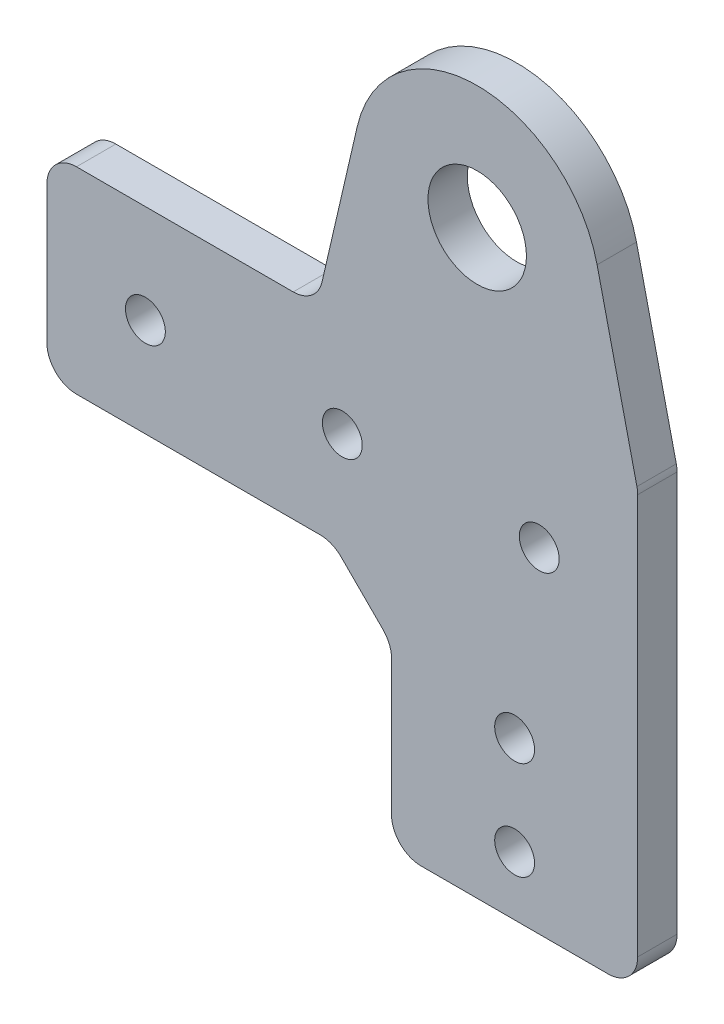
ISO-10303-21;
HEADER;
FILE_DESCRIPTION(('STEP AP214'),'2;1');
FILE_NAME('part.step','',(''),(''),'','','');
FILE_SCHEMA(('AUTOMOTIVE_DESIGN { 1 0 10303 214 1 1 1 1 }'));
ENDSEC;
DATA;
#1=APPLICATION_CONTEXT('core data for automotive mechanical design processes');
#2=APPLICATION_PROTOCOL_DEFINITION('international standard','automotive_design',2000,#1);
#3=PRODUCT_CONTEXT('',#1,'mechanical');
#4=PRODUCT('Part','Part','',(#3));
#5=PRODUCT_RELATED_PRODUCT_CATEGORY('part','',(#4));
#6=PRODUCT_DEFINITION_FORMATION('','',#4);
#7=PRODUCT_DEFINITION_CONTEXT('part definition',#1,'design');
#8=PRODUCT_DEFINITION('design','',#6,#7);
#9=PRODUCT_DEFINITION_SHAPE('','',#8);
#10=(LENGTH_UNIT() NAMED_UNIT(*) SI_UNIT(.MILLI.,.METRE.));
#11=(NAMED_UNIT(*) PLANE_ANGLE_UNIT() SI_UNIT($,.RADIAN.));
#12=(NAMED_UNIT(*) SI_UNIT($,.STERADIAN.) SOLID_ANGLE_UNIT());
#13=UNCERTAINTY_MEASURE_WITH_UNIT(LENGTH_MEASURE(1.E-05),#10,'distance_accuracy_value','');
#14=(GEOMETRIC_REPRESENTATION_CONTEXT(3) GLOBAL_UNCERTAINTY_ASSIGNED_CONTEXT((#13)) GLOBAL_UNIT_ASSIGNED_CONTEXT((#10,
#11,#12)) REPRESENTATION_CONTEXT('',''));
#15=CARTESIAN_POINT('',(0.,0.,0.));
#16=DIRECTION('',(0.,0.,1.));
#17=DIRECTION('',(1.,0.,0.));
#18=AXIS2_PLACEMENT_3D('',#15,#16,#17);
#19=CARTESIAN_POINT('',(-35.,20.,4.));
#20=DIRECTION('',(1.,0.,0.));
#21=DIRECTION('',(0.,1.,0.));
#22=AXIS2_PLACEMENT_3D('',#19,#20,#21);
#23=PLANE('',#22);
#24=DIRECTION('',(0.,-1.,0.));
#25=VECTOR('',#24,1.);
#26=CARTESIAN_POINT('',(-35.,20.,0.));
#27=LINE('',#26,#25);
#28=CARTESIAN_POINT('',(-35.,17.,0.));
#29=VERTEX_POINT('',#28);
#30=CARTESIAN_POINT('',(-35.,3.00000000000001,0.));
#31=VERTEX_POINT('',#30);
#32=EDGE_CURVE('E220',#29,#31,#27,.T.);
#33=ORIENTED_EDGE('',*,*,#32,.T.);
#34=DIRECTION('',(0.,0.,-1.));
#35=VECTOR('',#34,1.);
#36=CARTESIAN_POINT('',(-35.,3.00000000000001,4.));
#37=LINE('',#36,#35);
#38=CARTESIAN_POINT('',(-35.,3.00000000000001,4.));
#39=VERTEX_POINT('',#38);
#40=EDGE_CURVE('E298',#31,#39,#37,.F.);
#41=ORIENTED_EDGE('',*,*,#40,.T.);
#42=DIRECTION('',(0.,-1.,0.));
#43=VECTOR('',#42,1.);
#44=CARTESIAN_POINT('',(-35.,20.,4.));
#45=LINE('',#44,#43);
#46=CARTESIAN_POINT('',(-35.,17.,4.));
#47=VERTEX_POINT('',#46);
#48=EDGE_CURVE('E221',#47,#39,#45,.T.);
#49=ORIENTED_EDGE('',*,*,#48,.F.);
#50=DIRECTION('',(0.,0.,-1.));
#51=VECTOR('',#50,1.);
#52=CARTESIAN_POINT('',(-35.,17.,4.));
#53=LINE('',#52,#51);
#54=EDGE_CURVE('E295',#47,#29,#53,.T.);
#55=ORIENTED_EDGE('',*,*,#54,.T.);
#56=EDGE_LOOP('',(#33,#41,#49,#55));
#57=FACE_BOUND('',#56,.T.);
#58=ADVANCED_FACE('F35',(#57),#23,.F.);
#59=CARTESIAN_POINT('',(-35.,0.,4.));
#60=DIRECTION('',(0.,1.,0.));
#61=DIRECTION('',(0.,0.,1.));
#62=AXIS2_PLACEMENT_3D('',#59,#60,#61);
#63=PLANE('',#62);
#64=DIRECTION('',(1.,0.,0.));
#65=VECTOR('',#64,1.);
#66=CARTESIAN_POINT('',(-35.,0.,4.));
#67=LINE('',#66,#65);
#68=CARTESIAN_POINT('',(-32.,0.,4.));
#69=VERTEX_POINT('',#68);
#70=CARTESIAN_POINT('',(-7.24264068711929,0.,4.));
#71=VERTEX_POINT('',#70);
#72=EDGE_CURVE('E224',#69,#71,#67,.T.);
#73=ORIENTED_EDGE('',*,*,#72,.F.);
#74=DIRECTION('',(0.,0.,-1.));
#75=VECTOR('',#74,1.);
#76=CARTESIAN_POINT('',(-32.,0.,4.));
#77=LINE('',#76,#75);
#78=CARTESIAN_POINT('',(-32.,0.,0.));
#79=VERTEX_POINT('',#78);
#80=EDGE_CURVE('E292',#69,#79,#77,.T.);
#81=ORIENTED_EDGE('',*,*,#80,.T.);
#82=DIRECTION('',(1.,0.,0.));
#83=VECTOR('',#82,1.);
#84=CARTESIAN_POINT('',(-35.,0.,0.));
#85=LINE('',#84,#83);
#86=CARTESIAN_POINT('',(-7.24264068711929,0.,0.));
#87=VERTEX_POINT('',#86);
#88=EDGE_CURVE('E239',#79,#87,#85,.T.);
#89=ORIENTED_EDGE('',*,*,#88,.T.);
#90=DIRECTION('',(0.,0.,-1.));
#91=VECTOR('',#90,1.);
#92=CARTESIAN_POINT('',(-7.24264068711929,0.,4.));
#93=LINE('',#92,#91);
#94=EDGE_CURVE('E290',#87,#71,#93,.F.);
#95=ORIENTED_EDGE('',*,*,#94,.T.);
#96=EDGE_LOOP('',(#73,#81,#89,#95));
#97=FACE_BOUND('',#96,.T.);
#98=ADVANCED_FACE('F324',(#97),#63,.F.);
#99=CARTESIAN_POINT('',(0.,0.,4.));
#100=DIRECTION('',(1.,0.,0.));
#101=DIRECTION('',(0.,1.,0.));
#102=AXIS2_PLACEMENT_3D('',#99,#100,#101);
#103=PLANE('',#102);
#104=DIRECTION('',(0.,-1.,0.));
#105=VECTOR('',#104,1.);
#106=CARTESIAN_POINT('',(0.,0.,0.));
#107=LINE('',#106,#105);
#108=CARTESIAN_POINT('',(0.,-7.24264068711929,0.));
#109=VERTEX_POINT('',#108);
#110=CARTESIAN_POINT('',(0.,-21.,0.));
#111=VERTEX_POINT('',#110);
#112=EDGE_CURVE('E242',#109,#111,#107,.T.);
#113=ORIENTED_EDGE('',*,*,#112,.T.);
#114=DIRECTION('',(0.,0.,-1.));
#115=VECTOR('',#114,1.);
#116=CARTESIAN_POINT('',(0.,-21.,4.));
#117=LINE('',#116,#115);
#118=CARTESIAN_POINT('',(0.,-21.,4.));
#119=VERTEX_POINT('',#118);
#120=EDGE_CURVE('E50',#111,#119,#117,.F.);
#121=ORIENTED_EDGE('',*,*,#120,.T.);
#122=DIRECTION('',(0.,-1.,0.));
#123=VECTOR('',#122,1.);
#124=CARTESIAN_POINT('',(0.,0.,4.));
#125=LINE('',#124,#123);
#126=CARTESIAN_POINT('',(0.,-7.24264068711929,4.));
#127=VERTEX_POINT('',#126);
#128=EDGE_CURVE('E228',#127,#119,#125,.T.);
#129=ORIENTED_EDGE('',*,*,#128,.F.);
#130=DIRECTION('',(0.,0.,-1.));
#131=VECTOR('',#130,1.);
#132=CARTESIAN_POINT('',(0.,-7.24264068711929,4.));
#133=LINE('',#132,#131);
#134=EDGE_CURVE('E281',#127,#109,#133,.T.);
#135=ORIENTED_EDGE('',*,*,#134,.T.);
#136=EDGE_LOOP('',(#113,#121,#129,#135));
#137=FACE_BOUND('',#136,.T.);
#138=ADVANCED_FACE('F394',(#137),#103,.F.);
#139=CARTESIAN_POINT('',(25.,-30.,4.));
#140=DIRECTION('',(-1.,0.,0.));
#141=DIRECTION('',(0.,-1.,0.));
#142=AXIS2_PLACEMENT_3D('',#139,#140,#141);
#143=PLANE('',#142);
#144=DIRECTION('',(0.,1.,0.));
#145=VECTOR('',#144,1.);
#146=CARTESIAN_POINT('',(25.,-30.,4.));
#147=LINE('',#146,#145);
#148=CARTESIAN_POINT('',(25.,-21.,4.));
#149=VERTEX_POINT('',#148);
#150=CARTESIAN_POINT('',(25.,19.657531168234,4.));
#151=VERTEX_POINT('',#150);
#152=EDGE_CURVE('E230',#149,#151,#147,.T.);
#153=ORIENTED_EDGE('',*,*,#152,.F.);
#154=DIRECTION('',(0.,0.,-1.));
#155=VECTOR('',#154,1.);
#156=CARTESIAN_POINT('',(25.,-21.,4.));
#157=LINE('',#156,#155);
#158=CARTESIAN_POINT('',(25.,-21.,0.));
#159=VERTEX_POINT('',#158);
#160=EDGE_CURVE('E253',#149,#159,#157,.T.);
#161=ORIENTED_EDGE('',*,*,#160,.T.);
#162=DIRECTION('',(0.,1.,0.));
#163=VECTOR('',#162,1.);
#164=CARTESIAN_POINT('',(25.,-30.,0.));
#165=LINE('',#164,#163);
#166=CARTESIAN_POINT('',(25.,19.657531168234,0.));
#167=VERTEX_POINT('',#166);
#168=EDGE_CURVE('E244',#159,#167,#165,.T.);
#169=ORIENTED_EDGE('',*,*,#168,.T.);
#170=DIRECTION('',(0.,0.,-1.));
#171=VECTOR('',#170,1.);
#172=CARTESIAN_POINT('',(25.,19.657531168234,4.));
#173=LINE('',#172,#171);
#174=EDGE_CURVE('E251',#167,#151,#173,.F.);
#175=ORIENTED_EDGE('',*,*,#174,.T.);
#176=EDGE_LOOP('',(#153,#161,#169,#175));
#177=FACE_BOUND('',#176,.T.);
#178=ADVANCED_FACE('F433',(#177),#143,.F.);
#179=CARTESIAN_POINT('',(25.,20.,4.));
#180=DIRECTION('',(0.,-1.,0.));
#181=DIRECTION('',(1.,0.,0.));
#182=AXIS2_PLACEMENT_3D('',#179,#180,#181);
#183=PLANE('',#182);
#184=DIRECTION('',(-1.,0.,0.));
#185=VECTOR('',#184,1.);
#186=CARTESIAN_POINT('',(25.,20.,0.));
#187=LINE('',#186,#185);
#188=CARTESIAN_POINT('',(-9.98524094194186,20.,0.));
#189=VERTEX_POINT('',#188);
#190=CARTESIAN_POINT('',(-32.,20.,0.));
#191=VERTEX_POINT('',#190);
#192=EDGE_CURVE('E225',#189,#191,#187,.T.);
#193=ORIENTED_EDGE('',*,*,#192,.T.);
#194=DIRECTION('',(0.,0.,-1.));
#195=VECTOR('',#194,1.);
#196=CARTESIAN_POINT('',(-32.,20.,4.));
#197=LINE('',#196,#195);
#198=CARTESIAN_POINT('',(-32.,20.,4.));
#199=VERTEX_POINT('',#198);
#200=EDGE_CURVE('E303',#191,#199,#197,.F.);
#201=ORIENTED_EDGE('',*,*,#200,.T.);
#202=DIRECTION('',(-1.,0.,0.));
#203=VECTOR('',#202,1.);
#204=CARTESIAN_POINT('',(25.,20.,4.));
#205=LINE('',#204,#203);
#206=CARTESIAN_POINT('',(-9.98524094194186,20.,4.));
#207=VERTEX_POINT('',#206);
#208=EDGE_CURVE('E233',#207,#199,#205,.T.);
#209=ORIENTED_EDGE('',*,*,#208,.F.);
#210=DIRECTION('',(0.,0.,-1.));
#211=VECTOR('',#210,1.);
#212=CARTESIAN_POINT('',(-9.98524094194187,20.,4.));
#213=LINE('',#212,#211);
#214=EDGE_CURVE('E300',#207,#189,#213,.T.);
#215=ORIENTED_EDGE('',*,*,#214,.T.);
#216=EDGE_LOOP('',(#193,#201,#209,#215));
#217=FACE_BOUND('',#216,.T.);
#218=ADVANCED_FACE('F447',(#217),#183,.F.);
#219=CARTESIAN_POINT('',(0.,0.,4.));
#220=DIRECTION('',(0.,0.,1.));
#221=DIRECTION('',(1.,0.,0.));
#222=AXIS2_PLACEMENT_3D('',#219,#220,#221);
#223=PLANE('',#222);
#224=CARTESIAN_POINT('',(15.,10.,4.));
#225=DIRECTION('',(0.,0.,-1.));
#226=DIRECTION('',(-1.,0.,0.));
#227=AXIS2_PLACEMENT_3D('',#224,#225,#226);
#228=CIRCLE('',#227,2.025);
#229=CARTESIAN_POINT('',(12.975,10.,4.));
#230=VERTEX_POINT('',#229);
#231=EDGE_CURVE('E197',#230,#230,#228,.T.);
#232=ORIENTED_EDGE('',*,*,#231,.T.);
#233=EDGE_LOOP('',(#232));
#234=FACE_BOUND('',#233,.T.);
#235=CARTESIAN_POINT('',(-5.,10.,4.));
#236=DIRECTION('',(0.,0.,-1.));
#237=DIRECTION('',(-1.,0.,0.));
#238=AXIS2_PLACEMENT_3D('',#235,#236,#237);
#239=CIRCLE('',#238,2.025);
#240=CARTESIAN_POINT('',(-7.025,10.,4.));
#241=VERTEX_POINT('',#240);
#242=EDGE_CURVE('E346',#241,#241,#239,.T.);
#243=ORIENTED_EDGE('',*,*,#242,.T.);
#244=EDGE_LOOP('',(#243));
#245=FACE_BOUND('',#244,.T.);
#246=CARTESIAN_POINT('',(-25.,10.,4.));
#247=DIRECTION('',(0.,0.,-1.));
#248=DIRECTION('',(-1.,0.,0.));
#249=AXIS2_PLACEMENT_3D('',#246,#247,#248);
#250=CIRCLE('',#249,2.025);
#251=CARTESIAN_POINT('',(-27.025,10.,4.));
#252=VERTEX_POINT('',#251);
#253=EDGE_CURVE('E337',#252,#252,#250,.T.);
#254=ORIENTED_EDGE('',*,*,#253,.T.);
#255=EDGE_LOOP('',(#254));
#256=FACE_BOUND('',#255,.T.);
#257=DIRECTION('',(1.,0.,0.));
#258=VECTOR('',#257,1.);
#259=CARTESIAN_POINT('',(25.,-24.,4.));
#260=LINE('',#259,#258);
#261=CARTESIAN_POINT('',(3.00000000000001,-24.,4.));
#262=VERTEX_POINT('',#261);
#263=CARTESIAN_POINT('',(22.,-24.,4.));
#264=VERTEX_POINT('',#263);
#265=EDGE_CURVE('E203',#262,#264,#260,.T.);
#266=ORIENTED_EDGE('',*,*,#265,.T.);
#267=CARTESIAN_POINT('',(22.,-21.,4.));
#268=DIRECTION('',(0.,0.,1.));
#269=DIRECTION('',(1.,0.,0.));
#270=AXIS2_PLACEMENT_3D('',#267,#268,#269);
#271=CIRCLE('',#270,3.);
#272=EDGE_CURVE('E279',#264,#149,#271,.T.);
#273=ORIENTED_EDGE('',*,*,#272,.T.);
#274=ORIENTED_EDGE('',*,*,#152,.T.);
#275=CARTESIAN_POINT('',(22.,19.657531168234,4.));
#276=DIRECTION('',(0.,0.,1.));
#277=DIRECTION('',(1.,0.,0.));
#278=AXIS2_PLACEMENT_3D('',#275,#276,#277);
#279=CIRCLE('',#278,3.);
#280=CARTESIAN_POINT('',(24.9228159027552,20.3336577825611,4.));
#281=VERTEX_POINT('',#280);
#282=EDGE_CURVE('E271',#151,#281,#279,.T.);
#283=ORIENTED_EDGE('',*,*,#282,.T.);
#284=DIRECTION('',(0.225375538109041,-0.974271967585058,0.));
#285=VECTOR('',#284,1.);
#286=CARTESIAN_POINT('',(20.8783995948139,37.8171942263638,4.));
#287=LINE('',#286,#285);
#288=CARTESIAN_POINT('',(20.8783995948139,37.8171942263638,4.));
#289=VERTEX_POINT('',#288);
#290=EDGE_CURVE('E184',#289,#281,#287,.T.);
#291=ORIENTED_EDGE('',*,*,#290,.F.);
#292=CARTESIAN_POINT('',(8.70000000000071,35.0000000000008,4.));
#293=DIRECTION('',(0.,0.,1.));
#294=DIRECTION('',(1.,0.,0.));
#295=AXIS2_PLACEMENT_3D('',#292,#293,#294);
#296=CIRCLE('',#295,12.5);
#297=CARTESIAN_POINT('',(-3.47839959481276,37.8171942263627,4.));
#298=VERTEX_POINT('',#297);
#299=EDGE_CURVE('E195',#298,#289,#296,.F.);
#300=ORIENTED_EDGE('',*,*,#299,.F.);
#301=DIRECTION('',(0.225375538108956,0.974271967585078,0.));
#302=VECTOR('',#301,1.);
#303=CARTESIAN_POINT('',(-3.47839959481276,37.8171942263627,4.));
#304=LINE('',#303,#302);
#305=CARTESIAN_POINT('',(-7.06242503918664,22.3238733856731,4.));
#306=VERTEX_POINT('',#305);
#307=EDGE_CURVE('E180',#306,#298,#304,.T.);
#308=ORIENTED_EDGE('',*,*,#307,.F.);
#309=CARTESIAN_POINT('',(-9.98524094194187,23.,4.));
#310=DIRECTION('',(0.,0.,1.));
#311=DIRECTION('',(1.,0.,0.));
#312=AXIS2_PLACEMENT_3D('',#309,#310,#311);
#313=CIRCLE('',#312,3.);
#314=EDGE_CURVE('E314',#306,#207,#313,.F.);
#315=ORIENTED_EDGE('',*,*,#314,.T.);
#316=ORIENTED_EDGE('',*,*,#208,.T.);
#317=CARTESIAN_POINT('',(-32.,17.,4.));
#318=DIRECTION('',(0.,0.,1.));
#319=DIRECTION('',(1.,0.,0.));
#320=AXIS2_PLACEMENT_3D('',#317,#318,#319);
#321=CIRCLE('',#320,3.);
#322=EDGE_CURVE('E273',#199,#47,#321,.T.);
#323=ORIENTED_EDGE('',*,*,#322,.T.);
#324=ORIENTED_EDGE('',*,*,#48,.T.);
#325=CARTESIAN_POINT('',(-32.,3.,4.));
#326=DIRECTION('',(0.,0.,1.));
#327=DIRECTION('',(1.,0.,0.));
#328=AXIS2_PLACEMENT_3D('',#325,#326,#327);
#329=CIRCLE('',#328,3.);
#330=EDGE_CURVE('E275',#39,#69,#329,.T.);
#331=ORIENTED_EDGE('',*,*,#330,.T.);
#332=ORIENTED_EDGE('',*,*,#72,.T.);
#333=CARTESIAN_POINT('',(-7.24264068711929,-3.,4.));
#334=DIRECTION('',(0.,0.,1.));
#335=DIRECTION('',(1.,0.,0.));
#336=AXIS2_PLACEMENT_3D('',#333,#334,#335);
#337=CIRCLE('',#336,3.);
#338=CARTESIAN_POINT('',(-5.12132034355964,-0.878679656440356,4.));
#339=VERTEX_POINT('',#338);
#340=EDGE_CURVE('E11',#71,#339,#337,.F.);
#341=ORIENTED_EDGE('',*,*,#340,.T.);
#342=DIRECTION('',(-0.707106781186547,0.707106781186548,0.));
#343=VECTOR('',#342,1.);
#344=CARTESIAN_POINT('',(0.,-6.,4.));
#345=LINE('',#344,#343);
#346=CARTESIAN_POINT('',(-0.878679656440354,-5.12132034355965,4.));
#347=VERTEX_POINT('',#346);
#348=EDGE_CURVE('E330',#347,#339,#345,.T.);
#349=ORIENTED_EDGE('',*,*,#348,.F.);
#350=CARTESIAN_POINT('',(-3.,-7.24264068711929,4.));
#351=DIRECTION('',(0.,0.,1.));
#352=DIRECTION('',(1.,0.,0.));
#353=AXIS2_PLACEMENT_3D('',#350,#351,#352);
#354=CIRCLE('',#353,3.);
#355=EDGE_CURVE('E57',#347,#127,#354,.F.);
#356=ORIENTED_EDGE('',*,*,#355,.T.);
#357=ORIENTED_EDGE('',*,*,#128,.T.);
#358=CARTESIAN_POINT('',(3.00000000000001,-21.,4.));
#359=DIRECTION('',(0.,0.,1.));
#360=DIRECTION('',(1.,0.,0.));
#361=AXIS2_PLACEMENT_3D('',#358,#359,#360);
#362=CIRCLE('',#361,3.);
#363=EDGE_CURVE('E277',#119,#262,#362,.T.);
#364=ORIENTED_EDGE('',*,*,#363,.T.);
#365=EDGE_LOOP('',(#266,#273,#274,#283,#291,#300,#308,#315,#316,#323,#324,#331,#332,#341,#349,
#356,#357,#364));
#366=FACE_BOUND('',#365,.T.);
#367=CARTESIAN_POINT('',(12.5,-8.,4.));
#368=DIRECTION('',(0.,0.,-1.));
#369=DIRECTION('',(-1.,0.,0.));
#370=AXIS2_PLACEMENT_3D('',#367,#368,#369);
#371=CIRCLE('',#370,2.025);
#372=CARTESIAN_POINT('',(10.475,-8.,4.));
#373=VERTEX_POINT('',#372);
#374=EDGE_CURVE('E200',#373,#373,#371,.T.);
#375=ORIENTED_EDGE('',*,*,#374,.T.);
#376=EDGE_LOOP('',(#375));
#377=FACE_BOUND('',#376,.T.);
#378=CARTESIAN_POINT('',(12.5,-18.,4.));
#379=DIRECTION('',(0.,0.,-1.));
#380=DIRECTION('',(-1.,0.,0.));
#381=AXIS2_PLACEMENT_3D('',#378,#379,#380);
#382=CIRCLE('',#381,2.025);
#383=CARTESIAN_POINT('',(10.475,-18.,4.));
#384=VERTEX_POINT('',#383);
#385=EDGE_CURVE('E207',#384,#384,#382,.T.);
#386=ORIENTED_EDGE('',*,*,#385,.T.);
#387=EDGE_LOOP('',(#386));
#388=FACE_BOUND('',#387,.T.);
#389=CARTESIAN_POINT('',(8.70000000000071,35.0000000000008,4.));
#390=DIRECTION('',(0.,0.,1.));
#391=DIRECTION('',(1.,0.,0.));
#392=AXIS2_PLACEMENT_3D('',#389,#390,#391);
#393=CIRCLE('',#392,5.00000000000105);
#394=CARTESIAN_POINT('',(13.7000000000018,35.0000000000008,4.));
#395=VERTEX_POINT('',#394);
#396=EDGE_CURVE('E217',#395,#395,#393,.F.);
#397=ORIENTED_EDGE('',*,*,#396,.T.);
#398=EDGE_LOOP('',(#397));
#399=FACE_BOUND('',#398,.T.);
#400=ADVANCED_FACE('F328',(#234,#245,#256,#366,#377,#388,#399),#223,.T.);
#401=CARTESIAN_POINT('',(0.,0.,0.));
#402=DIRECTION('',(0.,0.,1.));
#403=DIRECTION('',(1.,0.,0.));
#404=AXIS2_PLACEMENT_3D('',#401,#402,#403);
#405=PLANE('',#404);
#406=CARTESIAN_POINT('',(15.,10.,0.));
#407=DIRECTION('',(0.,0.,-1.));
#408=DIRECTION('',(-1.,0.,0.));
#409=AXIS2_PLACEMENT_3D('',#406,#407,#408);
#410=CIRCLE('',#409,2.025);
#411=CARTESIAN_POINT('',(12.975,10.,0.));
#412=VERTEX_POINT('',#411);
#413=EDGE_CURVE('E343',#412,#412,#410,.T.);
#414=ORIENTED_EDGE('',*,*,#413,.F.);
#415=EDGE_LOOP('',(#414));
#416=FACE_BOUND('',#415,.T.);
#417=CARTESIAN_POINT('',(-5.,10.,0.));
#418=DIRECTION('',(0.,0.,-1.));
#419=DIRECTION('',(-1.,0.,0.));
#420=AXIS2_PLACEMENT_3D('',#417,#418,#419);
#421=CIRCLE('',#420,2.025);
#422=CARTESIAN_POINT('',(-7.025,10.,0.));
#423=VERTEX_POINT('',#422);
#424=EDGE_CURVE('E349',#423,#423,#421,.T.);
#425=ORIENTED_EDGE('',*,*,#424,.F.);
#426=EDGE_LOOP('',(#425));
#427=FACE_BOUND('',#426,.T.);
#428=CARTESIAN_POINT('',(-25.,10.,0.));
#429=DIRECTION('',(0.,0.,-1.));
#430=DIRECTION('',(-1.,0.,0.));
#431=AXIS2_PLACEMENT_3D('',#428,#429,#430);
#432=CIRCLE('',#431,2.025);
#433=CARTESIAN_POINT('',(-27.025,10.,0.));
#434=VERTEX_POINT('',#433);
#435=EDGE_CURVE('E334',#434,#434,#432,.T.);
#436=ORIENTED_EDGE('',*,*,#435,.F.);
#437=EDGE_LOOP('',(#436));
#438=FACE_BOUND('',#437,.T.);
#439=CARTESIAN_POINT('',(12.5,-8.,0.));
#440=DIRECTION('',(0.,0.,-1.));
#441=DIRECTION('',(-1.,0.,0.));
#442=AXIS2_PLACEMENT_3D('',#439,#440,#441);
#443=CIRCLE('',#442,2.025);
#444=CARTESIAN_POINT('',(10.475,-8.,0.));
#445=VERTEX_POINT('',#444);
#446=EDGE_CURVE('E204',#445,#445,#443,.T.);
#447=ORIENTED_EDGE('',*,*,#446,.F.);
#448=EDGE_LOOP('',(#447));
#449=FACE_BOUND('',#448,.T.);
#450=CARTESIAN_POINT('',(12.5,-18.,0.));
#451=DIRECTION('',(0.,0.,-1.));
#452=DIRECTION('',(-1.,0.,0.));
#453=AXIS2_PLACEMENT_3D('',#450,#451,#452);
#454=CIRCLE('',#453,2.025);
#455=CARTESIAN_POINT('',(10.475,-18.,0.));
#456=VERTEX_POINT('',#455);
#457=EDGE_CURVE('E173',#456,#456,#454,.T.);
#458=ORIENTED_EDGE('',*,*,#457,.F.);
#459=EDGE_LOOP('',(#458));
#460=FACE_BOUND('',#459,.T.);
#461=ORIENTED_EDGE('',*,*,#168,.F.);
#462=CARTESIAN_POINT('',(22.,-21.,0.));
#463=DIRECTION('',(0.,0.,1.));
#464=DIRECTION('',(1.,0.,0.));
#465=AXIS2_PLACEMENT_3D('',#462,#463,#464);
#466=CIRCLE('',#465,3.);
#467=CARTESIAN_POINT('',(22.,-24.,0.));
#468=VERTEX_POINT('',#467);
#469=EDGE_CURVE('E264',#159,#468,#466,.F.);
#470=ORIENTED_EDGE('',*,*,#469,.T.);
#471=DIRECTION('',(-1.,0.,0.));
#472=VECTOR('',#471,1.);
#473=CARTESIAN_POINT('',(0.,-24.,0.));
#474=LINE('',#473,#472);
#475=CARTESIAN_POINT('',(3.00000000000001,-24.,0.));
#476=VERTEX_POINT('',#475);
#477=EDGE_CURVE('E236',#468,#476,#474,.T.);
#478=ORIENTED_EDGE('',*,*,#477,.T.);
#479=CARTESIAN_POINT('',(3.00000000000001,-21.,0.));
#480=DIRECTION('',(0.,0.,1.));
#481=DIRECTION('',(1.,0.,0.));
#482=AXIS2_PLACEMENT_3D('',#479,#480,#481);
#483=CIRCLE('',#482,3.);
#484=EDGE_CURVE('E262',#476,#111,#483,.F.);
#485=ORIENTED_EDGE('',*,*,#484,.T.);
#486=ORIENTED_EDGE('',*,*,#112,.F.);
#487=CARTESIAN_POINT('',(-3.,-7.24264068711929,0.));
#488=DIRECTION('',(0.,0.,1.));
#489=DIRECTION('',(1.,0.,0.));
#490=AXIS2_PLACEMENT_3D('',#487,#488,#489);
#491=CIRCLE('',#490,3.);
#492=CARTESIAN_POINT('',(-0.878679656440354,-5.12132034355965,0.));
#493=VERTEX_POINT('',#492);
#494=EDGE_CURVE('E310',#109,#493,#491,.T.);
#495=ORIENTED_EDGE('',*,*,#494,.T.);
#496=DIRECTION('',(-0.707106781186547,0.707106781186548,0.));
#497=VECTOR('',#496,1.);
#498=CARTESIAN_POINT('',(0.,-6.,0.));
#499=LINE('',#498,#497);
#500=CARTESIAN_POINT('',(-5.12132034355964,-0.878679656440356,0.));
#501=VERTEX_POINT('',#500);
#502=EDGE_CURVE('E318',#493,#501,#499,.T.);
#503=ORIENTED_EDGE('',*,*,#502,.T.);
#504=CARTESIAN_POINT('',(-7.24264068711929,-3.,0.));
#505=DIRECTION('',(0.,0.,1.));
#506=DIRECTION('',(1.,0.,0.));
#507=AXIS2_PLACEMENT_3D('',#504,#505,#506);
#508=CIRCLE('',#507,3.);
#509=EDGE_CURVE('E43',#501,#87,#508,.T.);
#510=ORIENTED_EDGE('',*,*,#509,.T.);
#511=ORIENTED_EDGE('',*,*,#88,.F.);
#512=CARTESIAN_POINT('',(-32.,3.,0.));
#513=DIRECTION('',(0.,0.,1.));
#514=DIRECTION('',(1.,0.,0.));
#515=AXIS2_PLACEMENT_3D('',#512,#513,#514);
#516=CIRCLE('',#515,3.);
#517=EDGE_CURVE('E260',#79,#31,#516,.F.);
#518=ORIENTED_EDGE('',*,*,#517,.T.);
#519=ORIENTED_EDGE('',*,*,#32,.F.);
#520=CARTESIAN_POINT('',(-32.,17.,0.));
#521=DIRECTION('',(0.,0.,1.));
#522=DIRECTION('',(1.,0.,0.));
#523=AXIS2_PLACEMENT_3D('',#520,#521,#522);
#524=CIRCLE('',#523,3.);
#525=EDGE_CURVE('E258',#29,#191,#524,.F.);
#526=ORIENTED_EDGE('',*,*,#525,.T.);
#527=ORIENTED_EDGE('',*,*,#192,.F.);
#528=CARTESIAN_POINT('',(-9.98524094194187,23.,0.));
#529=DIRECTION('',(0.,0.,1.));
#530=DIRECTION('',(1.,0.,0.));
#531=AXIS2_PLACEMENT_3D('',#528,#529,#530);
#532=CIRCLE('',#531,3.);
#533=CARTESIAN_POINT('',(-7.06242503918664,22.3238733856731,0.));
#534=VERTEX_POINT('',#533);
#535=EDGE_CURVE('E170',#189,#534,#532,.T.);
#536=ORIENTED_EDGE('',*,*,#535,.T.);
#537=DIRECTION('',(0.225375538108956,0.974271967585077,0.));
#538=VECTOR('',#537,1.);
#539=CARTESIAN_POINT('',(-3.47839959481276,37.8171942263627,0.));
#540=LINE('',#539,#538);
#541=CARTESIAN_POINT('',(-3.47839959481276,37.8171942263627,0.));
#542=VERTEX_POINT('',#541);
#543=EDGE_CURVE('E161',#534,#542,#540,.T.);
#544=ORIENTED_EDGE('',*,*,#543,.T.);
#545=CARTESIAN_POINT('',(8.70000000000071,35.0000000000008,0.));
#546=DIRECTION('',(0.,0.,-1.));
#547=DIRECTION('',(-1.,0.,0.));
#548=AXIS2_PLACEMENT_3D('',#545,#546,#547);
#549=CIRCLE('',#548,12.5);
#550=CARTESIAN_POINT('',(20.8783995948139,37.8171942263638,0.));
#551=VERTEX_POINT('',#550);
#552=EDGE_CURVE('E168',#542,#551,#549,.T.);
#553=ORIENTED_EDGE('',*,*,#552,.T.);
#554=DIRECTION('',(0.225375538109041,-0.974271967585058,0.));
#555=VECTOR('',#554,1.);
#556=CARTESIAN_POINT('',(20.8783995948139,37.8171942263638,0.));
#557=LINE('',#556,#555);
#558=CARTESIAN_POINT('',(24.9228159027552,20.3336577825611,0.));
#559=VERTEX_POINT('',#558);
#560=EDGE_CURVE('E174',#551,#559,#557,.T.);
#561=ORIENTED_EDGE('',*,*,#560,.T.);
#562=CARTESIAN_POINT('',(22.,19.657531168234,0.));
#563=DIRECTION('',(0.,0.,1.));
#564=DIRECTION('',(1.,0.,0.));
#565=AXIS2_PLACEMENT_3D('',#562,#563,#564);
#566=CIRCLE('',#565,3.);
#567=EDGE_CURVE('E256',#559,#167,#566,.F.);
#568=ORIENTED_EDGE('',*,*,#567,.T.);
#569=EDGE_LOOP('',(#461,#470,#478,#485,#486,#495,#503,#510,#511,#518,#519,#526,#527,#536,#544,
#553,#561,#568));
#570=FACE_BOUND('',#569,.T.);
#571=CARTESIAN_POINT('',(8.70000000000071,35.0000000000008,0.));
#572=DIRECTION('',(0.,0.,-1.));
#573=DIRECTION('',(-1.,0.,0.));
#574=AXIS2_PLACEMENT_3D('',#571,#572,#573);
#575=CIRCLE('',#574,5.00000000000105);
#576=CARTESIAN_POINT('',(3.69999999999966,35.0000000000008,0.));
#577=VERTEX_POINT('',#576);
#578=EDGE_CURVE('E214',#577,#577,#575,.T.);
#579=ORIENTED_EDGE('',*,*,#578,.F.);
#580=EDGE_LOOP('',(#579));
#581=FACE_BOUND('',#580,.T.);
#582=ADVANCED_FACE('F164',(#416,#427,#438,#449,#460,#570,#581),#405,.F.);
#583=CARTESIAN_POINT('',(8.70000000000071,35.0000000000008,18.1421356237339));
#584=DIRECTION('',(0.,0.,-1.));
#585=DIRECTION('',(-1.,0.,0.));
#586=AXIS2_PLACEMENT_3D('',#583,#584,#585);
#587=CYLINDRICAL_SURFACE('',#586,5.00000000000105);
#588=ORIENTED_EDGE('',*,*,#578,.T.);
#589=EDGE_LOOP('',(#588));
#590=FACE_BOUND('',#589,.T.);
#591=ORIENTED_EDGE('',*,*,#396,.F.);
#592=EDGE_LOOP('',(#591));
#593=FACE_BOUND('',#592,.T.);
#594=ADVANCED_FACE('F366',(#590,#593),#587,.F.);
#595=CARTESIAN_POINT('',(25.,-24.,4.));
#596=DIRECTION('',(0.,1.,0.));
#597=DIRECTION('',(-1.,0.,0.));
#598=AXIS2_PLACEMENT_3D('',#595,#596,#597);
#599=PLANE('',#598);
#600=ORIENTED_EDGE('',*,*,#477,.F.);
#601=DIRECTION('',(0.,0.,-1.));
#602=VECTOR('',#601,1.);
#603=CARTESIAN_POINT('',(22.,-24.,4.));
#604=LINE('',#603,#602);
#605=EDGE_CURVE('E269',#468,#264,#604,.F.);
#606=ORIENTED_EDGE('',*,*,#605,.T.);
#607=ORIENTED_EDGE('',*,*,#265,.F.);
#608=DIRECTION('',(0.,0.,-1.));
#609=VECTOR('',#608,1.);
#610=CARTESIAN_POINT('',(3.00000000000001,-24.,4.));
#611=LINE('',#610,#609);
#612=EDGE_CURVE('E266',#262,#476,#611,.T.);
#613=ORIENTED_EDGE('',*,*,#612,.T.);
#614=EDGE_LOOP('',(#600,#606,#607,#613));
#615=FACE_BOUND('',#614,.T.);
#616=ADVANCED_FACE('F376',(#615),#599,.F.);
#617=CARTESIAN_POINT('',(12.5,-18.,4.));
#618=DIRECTION('',(0.,0.,-1.));
#619=DIRECTION('',(-1.,0.,0.));
#620=AXIS2_PLACEMENT_3D('',#617,#618,#619);
#621=CYLINDRICAL_SURFACE('',#620,2.025);
#622=ORIENTED_EDGE('',*,*,#385,.F.);
#623=EDGE_LOOP('',(#622));
#624=FACE_BOUND('',#623,.T.);
#625=ORIENTED_EDGE('',*,*,#457,.T.);
#626=EDGE_LOOP('',(#625));
#627=FACE_BOUND('',#626,.T.);
#628=ADVANCED_FACE('F373',(#624,#627),#621,.F.);
#629=CARTESIAN_POINT('',(12.5,-8.,4.));
#630=DIRECTION('',(0.,0.,-1.));
#631=DIRECTION('',(-1.,0.,0.));
#632=AXIS2_PLACEMENT_3D('',#629,#630,#631);
#633=CYLINDRICAL_SURFACE('',#632,2.025);
#634=ORIENTED_EDGE('',*,*,#374,.F.);
#635=EDGE_LOOP('',(#634));
#636=FACE_BOUND('',#635,.T.);
#637=ORIENTED_EDGE('',*,*,#446,.T.);
#638=EDGE_LOOP('',(#637));
#639=FACE_BOUND('',#638,.T.);
#640=ADVANCED_FACE('F375',(#636,#639),#633,.F.);
#641=CARTESIAN_POINT('',(8.70000000000071,35.0000000000008,46.6498534581286));
#642=DIRECTION('',(0.,0.,-1.));
#643=DIRECTION('',(-1.,0.,0.));
#644=AXIS2_PLACEMENT_3D('',#641,#642,#643);
#645=CYLINDRICAL_SURFACE('',#644,12.5);
#646=DIRECTION('',(0.,0.,-1.));
#647=VECTOR('',#646,1.);
#648=CARTESIAN_POINT('',(-3.47839959481276,37.8171942263627,46.6498534581286));
#649=LINE('',#648,#647);
#650=EDGE_CURVE('E177',#298,#542,#649,.T.);
#651=ORIENTED_EDGE('',*,*,#650,.F.);
#652=ORIENTED_EDGE('',*,*,#299,.T.);
#653=DIRECTION('',(0.,0.,-1.));
#654=VECTOR('',#653,1.);
#655=CARTESIAN_POINT('',(20.8783995948139,37.8171942263638,46.6498534581286));
#656=LINE('',#655,#654);
#657=EDGE_CURVE('E188',#289,#551,#656,.T.);
#658=ORIENTED_EDGE('',*,*,#657,.T.);
#659=ORIENTED_EDGE('',*,*,#552,.F.);
#660=EDGE_LOOP('',(#651,#652,#658,#659));
#661=FACE_BOUND('',#660,.T.);
#662=ADVANCED_FACE('F186',(#661),#645,.T.);
#663=CARTESIAN_POINT('',(-3.47839959481276,37.8171942263627,46.6498534581286));
#664=DIRECTION('',(-0.974271967585078,0.225375538108956,0.));
#665=DIRECTION('',(-0.225375538108956,-0.974271967585078,0.));
#666=AXIS2_PLACEMENT_3D('',#663,#664,#665);
#667=PLANE('',#666);
#668=ORIENTED_EDGE('',*,*,#543,.F.);
#669=DIRECTION('',(0.,0.,-1.));
#670=VECTOR('',#669,1.);
#671=CARTESIAN_POINT('',(-7.06242503918664,22.3238733856731,46.6498534581286));
#672=LINE('',#671,#670);
#673=EDGE_CURVE('E305',#534,#306,#672,.F.);
#674=ORIENTED_EDGE('',*,*,#673,.T.);
#675=ORIENTED_EDGE('',*,*,#307,.T.);
#676=ORIENTED_EDGE('',*,*,#650,.T.);
#677=EDGE_LOOP('',(#668,#674,#675,#676));
#678=FACE_BOUND('',#677,.T.);
#679=ADVANCED_FACE('F178',(#678),#667,.T.);
#680=CARTESIAN_POINT('',(20.8783995948139,37.8171942263638,46.6498534581286));
#681=DIRECTION('',(0.974271967585058,0.225375538109041,0.));
#682=DIRECTION('',(-0.225375538109041,0.974271967585058,0.));
#683=AXIS2_PLACEMENT_3D('',#680,#681,#682);
#684=PLANE('',#683);
#685=ORIENTED_EDGE('',*,*,#290,.T.);
#686=DIRECTION('',(0.,0.,-1.));
#687=VECTOR('',#686,1.);
#688=CARTESIAN_POINT('',(24.9228159027552,20.3336577825611,0.));
#689=LINE('',#688,#687);
#690=EDGE_CURVE('E307',#281,#559,#689,.T.);
#691=ORIENTED_EDGE('',*,*,#690,.T.);
#692=ORIENTED_EDGE('',*,*,#560,.F.);
#693=ORIENTED_EDGE('',*,*,#657,.F.);
#694=EDGE_LOOP('',(#685,#691,#692,#693));
#695=FACE_BOUND('',#694,.T.);
#696=ADVANCED_FACE('F360',(#695),#684,.T.);
#697=CARTESIAN_POINT('',(-25.,10.,4.));
#698=DIRECTION('',(0.,0.,-1.));
#699=DIRECTION('',(-1.,0.,0.));
#700=AXIS2_PLACEMENT_3D('',#697,#698,#699);
#701=CYLINDRICAL_SURFACE('',#700,2.025);
#702=ORIENTED_EDGE('',*,*,#253,.F.);
#703=EDGE_LOOP('',(#702));
#704=FACE_BOUND('',#703,.T.);
#705=ORIENTED_EDGE('',*,*,#435,.T.);
#706=EDGE_LOOP('',(#705));
#707=FACE_BOUND('',#706,.T.);
#708=ADVANCED_FACE('F356',(#704,#707),#701,.F.);
#709=CARTESIAN_POINT('',(-5.,10.,4.));
#710=DIRECTION('',(0.,0.,-1.));
#711=DIRECTION('',(-1.,0.,0.));
#712=AXIS2_PLACEMENT_3D('',#709,#710,#711);
#713=CYLINDRICAL_SURFACE('',#712,2.025);
#714=ORIENTED_EDGE('',*,*,#242,.F.);
#715=EDGE_LOOP('',(#714));
#716=FACE_BOUND('',#715,.T.);
#717=ORIENTED_EDGE('',*,*,#424,.T.);
#718=EDGE_LOOP('',(#717));
#719=FACE_BOUND('',#718,.T.);
#720=ADVANCED_FACE('F359',(#716,#719),#713,.F.);
#721=CARTESIAN_POINT('',(15.,10.,4.));
#722=DIRECTION('',(0.,0.,-1.));
#723=DIRECTION('',(-1.,0.,0.));
#724=AXIS2_PLACEMENT_3D('',#721,#722,#723);
#725=CYLINDRICAL_SURFACE('',#724,2.025);
#726=ORIENTED_EDGE('',*,*,#231,.F.);
#727=EDGE_LOOP('',(#726));
#728=FACE_BOUND('',#727,.T.);
#729=ORIENTED_EDGE('',*,*,#413,.T.);
#730=EDGE_LOOP('',(#729));
#731=FACE_BOUND('',#730,.T.);
#732=ADVANCED_FACE('F502',(#728,#731),#725,.F.);
#733=CARTESIAN_POINT('',(0.,-6.,12.4852813742386));
#734=DIRECTION('',(-0.707106781186548,-0.707106781186548,0.));
#735=DIRECTION('',(0.707106781186547,-0.707106781186548,0.));
#736=AXIS2_PLACEMENT_3D('',#733,#734,#735);
#737=PLANE('',#736);
#738=ORIENTED_EDGE('',*,*,#502,.F.);
#739=DIRECTION('',(0.,0.,-1.));
#740=VECTOR('',#739,1.);
#741=CARTESIAN_POINT('',(-0.878679656440354,-5.12132034355965,12.4852813742386));
#742=LINE('',#741,#740);
#743=EDGE_CURVE('E288',#493,#347,#742,.F.);
#744=ORIENTED_EDGE('',*,*,#743,.T.);
#745=ORIENTED_EDGE('',*,*,#348,.T.);
#746=DIRECTION('',(0.,0.,-1.));
#747=VECTOR('',#746,1.);
#748=CARTESIAN_POINT('',(-5.12132034355964,-0.878679656440356,12.4852813742386));
#749=LINE('',#748,#747);
#750=EDGE_CURVE('E285',#339,#501,#749,.T.);
#751=ORIENTED_EDGE('',*,*,#750,.T.);
#752=EDGE_LOOP('',(#738,#744,#745,#751));
#753=FACE_BOUND('',#752,.T.);
#754=ADVANCED_FACE('F332',(#753),#737,.T.);
#755=CARTESIAN_POINT('',(22.,-21.,4.));
#756=DIRECTION('',(0.,0.,-1.));
#757=DIRECTION('',(-1.,0.,0.));
#758=AXIS2_PLACEMENT_3D('',#755,#756,#757);
#759=CYLINDRICAL_SURFACE('',#758,3.);
#760=ORIENTED_EDGE('',*,*,#272,.F.);
#761=ORIENTED_EDGE('',*,*,#605,.F.);
#762=ORIENTED_EDGE('',*,*,#469,.F.);
#763=ORIENTED_EDGE('',*,*,#160,.F.);
#764=EDGE_LOOP('',(#760,#761,#762,#763));
#765=FACE_BOUND('',#764,.T.);
#766=ADVANCED_FACE('F398',(#765),#759,.T.);
#767=CARTESIAN_POINT('',(3.00000000000001,-21.,4.));
#768=DIRECTION('',(0.,0.,-1.));
#769=DIRECTION('',(-1.,0.,0.));
#770=AXIS2_PLACEMENT_3D('',#767,#768,#769);
#771=CYLINDRICAL_SURFACE('',#770,3.);
#772=ORIENTED_EDGE('',*,*,#363,.F.);
#773=ORIENTED_EDGE('',*,*,#120,.F.);
#774=ORIENTED_EDGE('',*,*,#484,.F.);
#775=ORIENTED_EDGE('',*,*,#612,.F.);
#776=EDGE_LOOP('',(#772,#773,#774,#775));
#777=FACE_BOUND('',#776,.T.);
#778=ADVANCED_FACE('F401',(#777),#771,.T.);
#779=CARTESIAN_POINT('',(-3.,-7.24264068711929,4.));
#780=DIRECTION('',(0.,0.,-1.));
#781=DIRECTION('',(-1.,0.,0.));
#782=AXIS2_PLACEMENT_3D('',#779,#780,#781);
#783=CYLINDRICAL_SURFACE('',#782,3.);
#784=ORIENTED_EDGE('',*,*,#355,.F.);
#785=ORIENTED_EDGE('',*,*,#743,.F.);
#786=ORIENTED_EDGE('',*,*,#494,.F.);
#787=ORIENTED_EDGE('',*,*,#134,.F.);
#788=EDGE_LOOP('',(#784,#785,#786,#787));
#789=FACE_BOUND('',#788,.T.);
#790=ADVANCED_FACE('F405',(#789),#783,.F.);
#791=CARTESIAN_POINT('',(-32.,3.,4.));
#792=DIRECTION('',(0.,0.,-1.));
#793=DIRECTION('',(-1.,0.,0.));
#794=AXIS2_PLACEMENT_3D('',#791,#792,#793);
#795=CYLINDRICAL_SURFACE('',#794,3.);
#796=ORIENTED_EDGE('',*,*,#330,.F.);
#797=ORIENTED_EDGE('',*,*,#40,.F.);
#798=ORIENTED_EDGE('',*,*,#517,.F.);
#799=ORIENTED_EDGE('',*,*,#80,.F.);
#800=EDGE_LOOP('',(#796,#797,#798,#799));
#801=FACE_BOUND('',#800,.T.);
#802=ADVANCED_FACE('F409',(#801),#795,.T.);
#803=CARTESIAN_POINT('',(-32.,17.,4.));
#804=DIRECTION('',(0.,0.,-1.));
#805=DIRECTION('',(-1.,0.,0.));
#806=AXIS2_PLACEMENT_3D('',#803,#804,#805);
#807=CYLINDRICAL_SURFACE('',#806,3.);
#808=ORIENTED_EDGE('',*,*,#322,.F.);
#809=ORIENTED_EDGE('',*,*,#200,.F.);
#810=ORIENTED_EDGE('',*,*,#525,.F.);
#811=ORIENTED_EDGE('',*,*,#54,.F.);
#812=EDGE_LOOP('',(#808,#809,#810,#811));
#813=FACE_BOUND('',#812,.T.);
#814=ADVANCED_FACE('F413',(#813),#807,.T.);
#815=CARTESIAN_POINT('',(-9.98524094194187,23.,4.));
#816=DIRECTION('',(0.,0.,-1.));
#817=DIRECTION('',(-1.,0.,0.));
#818=AXIS2_PLACEMENT_3D('',#815,#816,#817);
#819=CYLINDRICAL_SURFACE('',#818,3.);
#820=ORIENTED_EDGE('',*,*,#314,.F.);
#821=ORIENTED_EDGE('',*,*,#673,.F.);
#822=ORIENTED_EDGE('',*,*,#535,.F.);
#823=ORIENTED_EDGE('',*,*,#214,.F.);
#824=EDGE_LOOP('',(#820,#821,#822,#823));
#825=FACE_BOUND('',#824,.T.);
#826=ADVANCED_FACE('F417',(#825),#819,.F.);
#827=CARTESIAN_POINT('',(22.,19.657531168234,46.6498534581286));
#828=DIRECTION('',(0.,0.,1.));
#829=DIRECTION('',(1.,0.,0.));
#830=AXIS2_PLACEMENT_3D('',#827,#828,#829);
#831=CYLINDRICAL_SURFACE('',#830,3.);
#832=ORIENTED_EDGE('',*,*,#282,.F.);
#833=ORIENTED_EDGE('',*,*,#174,.F.);
#834=ORIENTED_EDGE('',*,*,#567,.F.);
#835=ORIENTED_EDGE('',*,*,#690,.F.);
#836=EDGE_LOOP('',(#832,#833,#834,#835));
#837=FACE_BOUND('',#836,.T.);
#838=ADVANCED_FACE('F420',(#837),#831,.T.);
#839=CARTESIAN_POINT('',(-7.24264068711929,-3.,12.4852813742386));
#840=DIRECTION('',(0.,0.,-1.));
#841=DIRECTION('',(-1.,0.,0.));
#842=AXIS2_PLACEMENT_3D('',#839,#840,#841);
#843=CYLINDRICAL_SURFACE('',#842,3.);
#844=ORIENTED_EDGE('',*,*,#340,.F.);
#845=ORIENTED_EDGE('',*,*,#94,.F.);
#846=ORIENTED_EDGE('',*,*,#509,.F.);
#847=ORIENTED_EDGE('',*,*,#750,.F.);
#848=EDGE_LOOP('',(#844,#845,#846,#847));
#849=FACE_BOUND('',#848,.T.);
#850=ADVANCED_FACE('F37',(#849),#843,.F.);
#851=CLOSED_SHELL('',(#58,#98,#138,#178,#218,#400,#582,#594,#616,#628,#640,#662,#679,#696,#708,
#720,#732,#754,#766,#778,#790,#802,#814,#826,#838,#850));
#852=MANIFOLD_SOLID_BREP('B2',#851);
#853=ADVANCED_BREP_SHAPE_REPRESENTATION('',(#18,#852),#14);
#854=SHAPE_DEFINITION_REPRESENTATION(#9,#853);
ENDSEC;
END-ISO-10303-21;
